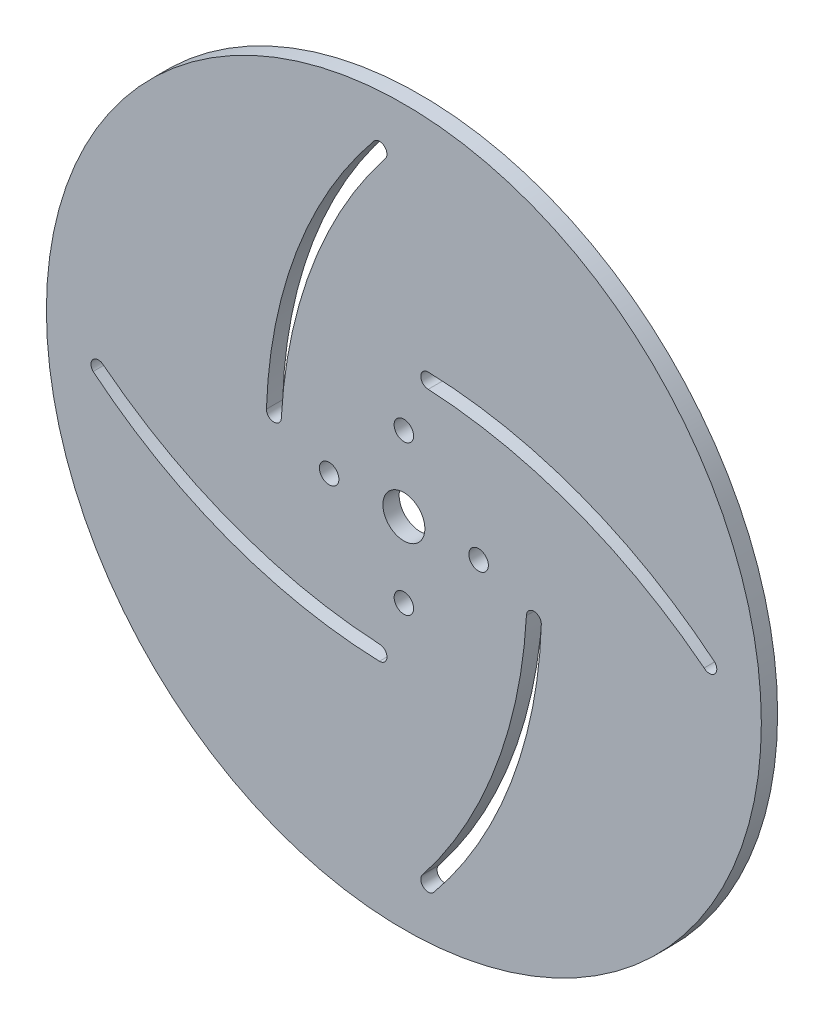
ISO-10303-21;
HEADER;
FILE_DESCRIPTION(('STEP AP214'),'2;1');
FILE_NAME('part.step','',(''),(''),'','','');
FILE_SCHEMA(('AUTOMOTIVE_DESIGN { 1 0 10303 214 1 1 1 1 }'));
ENDSEC;
DATA;
#1=APPLICATION_CONTEXT('core data for automotive mechanical design processes');
#2=APPLICATION_PROTOCOL_DEFINITION('international standard','automotive_design',2000,#1);
#3=PRODUCT_CONTEXT('',#1,'mechanical');
#4=PRODUCT('Part','Part','',(#3));
#5=PRODUCT_RELATED_PRODUCT_CATEGORY('part','',(#4));
#6=PRODUCT_DEFINITION_FORMATION('','',#4);
#7=PRODUCT_DEFINITION_CONTEXT('part definition',#1,'design');
#8=PRODUCT_DEFINITION('design','',#6,#7);
#9=PRODUCT_DEFINITION_SHAPE('','',#8);
#10=(LENGTH_UNIT() NAMED_UNIT(*) SI_UNIT(.MILLI.,.METRE.));
#11=(NAMED_UNIT(*) PLANE_ANGLE_UNIT() SI_UNIT($,.RADIAN.));
#12=(NAMED_UNIT(*) SI_UNIT($,.STERADIAN.) SOLID_ANGLE_UNIT());
#13=UNCERTAINTY_MEASURE_WITH_UNIT(LENGTH_MEASURE(1.E-05),#10,'distance_accuracy_value','');
#14=(GEOMETRIC_REPRESENTATION_CONTEXT(3) GLOBAL_UNCERTAINTY_ASSIGNED_CONTEXT((#13)) GLOBAL_UNIT_ASSIGNED_CONTEXT((#10,
#11,#12)) REPRESENTATION_CONTEXT('',''));
#15=CARTESIAN_POINT('',(0.,0.,0.));
#16=DIRECTION('',(0.,0.,1.));
#17=DIRECTION('',(1.,0.,0.));
#18=AXIS2_PLACEMENT_3D('',#15,#16,#17);
#19=CARTESIAN_POINT('',(0.,0.,3.175));
#20=DIRECTION('',(0.,0.,1.));
#21=DIRECTION('',(1.,0.,0.));
#22=AXIS2_PLACEMENT_3D('',#19,#20,#21);
#23=PLANE('',#22);
#24=CARTESIAN_POINT('',(14.605,0.,3.175));
#25=DIRECTION('',(0.,0.,1.));
#26=DIRECTION('',(1.,0.,0.));
#27=AXIS2_PLACEMENT_3D('',#24,#25,#26);
#28=CIRCLE('',#27,1.905);
#29=CARTESIAN_POINT('',(16.51,0.,3.175));
#30=VERTEX_POINT('',#29);
#31=EDGE_CURVE('E372',#30,#30,#28,.T.);
#32=ORIENTED_EDGE('',*,*,#31,.F.);
#33=EDGE_LOOP('',(#32));
#34=FACE_BOUND('',#33,.T.);
#35=CARTESIAN_POINT('',(0.,-14.605,3.175));
#36=DIRECTION('',(0.,0.,1.));
#37=DIRECTION('',(1.,0.,0.));
#38=AXIS2_PLACEMENT_3D('',#35,#36,#37);
#39=CIRCLE('',#38,1.905);
#40=CARTESIAN_POINT('',(1.90499999999995,-14.605,3.175));
#41=VERTEX_POINT('',#40);
#42=EDGE_CURVE('E376',#41,#41,#39,.T.);
#43=ORIENTED_EDGE('',*,*,#42,.F.);
#44=EDGE_LOOP('',(#43));
#45=FACE_BOUND('',#44,.T.);
#46=CARTESIAN_POINT('',(-14.605,1.01986169907608E-13,3.175));
#47=DIRECTION('',(0.,0.,1.));
#48=DIRECTION('',(1.,0.,0.));
#49=AXIS2_PLACEMENT_3D('',#46,#47,#48);
#50=CIRCLE('',#49,1.905);
#51=CARTESIAN_POINT('',(-12.7,1.01986169907608E-13,3.175));
#52=VERTEX_POINT('',#51);
#53=EDGE_CURVE('E380',#52,#52,#50,.T.);
#54=ORIENTED_EDGE('',*,*,#53,.F.);
#55=EDGE_LOOP('',(#54));
#56=FACE_BOUND('',#55,.T.);
#57=CARTESIAN_POINT('',(1.52979254861412E-13,14.605,3.175));
#58=DIRECTION('',(0.,0.,1.));
#59=DIRECTION('',(1.,0.,0.));
#60=AXIS2_PLACEMENT_3D('',#57,#58,#59);
#61=CIRCLE('',#60,1.905);
#62=CARTESIAN_POINT('',(1.90500000000015,14.605,3.175));
#63=VERTEX_POINT('',#62);
#64=EDGE_CURVE('E384',#63,#63,#61,.T.);
#65=ORIENTED_EDGE('',*,*,#64,.F.);
#66=EDGE_LOOP('',(#65));
#67=FACE_BOUND('',#66,.T.);
#68=CARTESIAN_POINT('',(0.,0.,3.175));
#69=DIRECTION('',(0.,0.,1.));
#70=DIRECTION('',(1.,0.,0.));
#71=AXIS2_PLACEMENT_3D('',#68,#69,#70);
#72=CIRCLE('',#71,69.85);
#73=CARTESIAN_POINT('',(69.85,0.,3.175));
#74=VERTEX_POINT('',#73);
#75=EDGE_CURVE('E11',#74,#74,#72,.T.);
#76=ORIENTED_EDGE('',*,*,#75,.T.);
#77=EDGE_LOOP('',(#76));
#78=FACE_BOUND('',#77,.T.);
#79=CARTESIAN_POINT('',(0.,0.,3.175));
#80=DIRECTION('',(0.,0.,1.));
#81=DIRECTION('',(1.,0.,0.));
#82=AXIS2_PLACEMENT_3D('',#79,#80,#81);
#83=CIRCLE('',#82,4.1);
#84=CARTESIAN_POINT('',(4.1,0.,3.175));
#85=VERTEX_POINT('',#84);
#86=EDGE_CURVE('E337',#85,#85,#83,.T.);
#87=ORIENTED_EDGE('',*,*,#86,.F.);
#88=EDGE_LOOP('',(#87));
#89=FACE_BOUND('',#88,.T.);
#90=CARTESIAN_POINT('',(71.7708058026314,-0.380003685692111,3.175));
#91=DIRECTION('',(0.,0.,-1.));
#92=DIRECTION('',(-1.,0.,0.));
#93=AXIS2_PLACEMENT_3D('',#90,#91,#92);
#94=CIRCLE('',#93,95.8518294787441);
#95=CARTESIAN_POINT('',(-23.9429752242943,4.76249920219739,3.175));
#96=VERTEX_POINT('',#95);
#97=CARTESIAN_POINT('',(-3.73659518151881,58.6640951815188,3.175));
#98=VERTEX_POINT('',#97);
#99=EDGE_CURVE('E297',#96,#98,#94,.T.);
#100=ORIENTED_EDGE('',*,*,#99,.F.);
#101=CARTESIAN_POINT('',(-25.3999230379934,4.76249920219739,3.175));
#102=DIRECTION('',(0.,0.,1.));
#103=DIRECTION('',(1.,0.,0.));
#104=AXIS2_PLACEMENT_3D('',#101,#102,#103);
#105=CIRCLE('',#104,1.45694781369914);
#106=CARTESIAN_POINT('',(-26.8567925777632,4.77760138527487,3.175));
#107=VERTEX_POINT('',#106);
#108=EDGE_CURVE('E294',#107,#96,#105,.T.);
#109=ORIENTED_EDGE('',*,*,#108,.F.);
#110=CARTESIAN_POINT('',(66.0400624487728,1.72599674302421,3.175));
#111=DIRECTION('',(0.,0.,1.));
#112=DIRECTION('',(1.,0.,0.));
#113=AXIS2_PLACEMENT_3D('',#110,#111,#112);
#114=CIRCLE('',#113,92.9469631817729);
#115=CARTESIAN_POINT('',(-5.78840481848121,60.7159048184812,3.175));
#116=VERTEX_POINT('',#115);
#117=EDGE_CURVE('E305',#116,#107,#114,.T.);
#118=ORIENTED_EDGE('',*,*,#117,.F.);
#119=CARTESIAN_POINT('',(-4.7625,59.69,3.175));
#120=DIRECTION('',(0.,0.,1.));
#121=DIRECTION('',(-1.,0.,0.));
#122=AXIS2_PLACEMENT_3D('',#119,#120,#121);
#123=CIRCLE('',#122,1.450848508);
#124=EDGE_CURVE('E301',#98,#116,#123,.T.);
#125=ORIENTED_EDGE('',*,*,#124,.F.);
#126=EDGE_LOOP('',(#100,#109,#118,#125));
#127=FACE_BOUND('',#126,.T.);
#128=CARTESIAN_POINT('',(59.69,4.76249999999979,3.175));
#129=DIRECTION('',(0.,0.,1.));
#130=DIRECTION('',(-1.,0.,0.));
#131=AXIS2_PLACEMENT_3D('',#128,#129,#130);
#132=CIRCLE('',#131,1.450848508);
#133=CARTESIAN_POINT('',(58.6640951815188,3.73659518151859,3.175));
#134=VERTEX_POINT('',#133);
#135=CARTESIAN_POINT('',(60.7159048184812,5.78840481848095,3.175));
#136=VERTEX_POINT('',#135);
#137=EDGE_CURVE('E254',#134,#136,#132,.T.);
#138=ORIENTED_EDGE('',*,*,#137,.F.);
#139=CARTESIAN_POINT('',(-0.380003685692362,-71.7708058026314,3.175));
#140=DIRECTION('',(0.,0.,-1.));
#141=DIRECTION('',(-1.,0.,0.));
#142=AXIS2_PLACEMENT_3D('',#139,#140,#141);
#143=CIRCLE('',#142,95.8518294787441);
#144=CARTESIAN_POINT('',(4.76249920219747,23.9429752242943,3.175));
#145=VERTEX_POINT('',#144);
#146=EDGE_CURVE('E251',#145,#134,#143,.T.);
#147=ORIENTED_EDGE('',*,*,#146,.F.);
#148=CARTESIAN_POINT('',(4.76249920219748,25.3999230379934,3.175));
#149=DIRECTION('',(0.,0.,1.));
#150=DIRECTION('',(1.,0.,0.));
#151=AXIS2_PLACEMENT_3D('',#148,#149,#150);
#152=CIRCLE('',#151,1.45694781369914);
#153=CARTESIAN_POINT('',(4.77760138527496,26.8567925777632,3.175));
#154=VERTEX_POINT('',#153);
#155=EDGE_CURVE('E262',#154,#145,#152,.T.);
#156=ORIENTED_EDGE('',*,*,#155,.F.);
#157=CARTESIAN_POINT('',(1.72599674302395,-66.0400624487724,3.175));
#158=DIRECTION('',(0.,0.,1.));
#159=DIRECTION('',(1.,0.,0.));
#160=AXIS2_PLACEMENT_3D('',#157,#158,#159);
#161=CIRCLE('',#160,92.9469631817725);
#162=EDGE_CURVE('E258',#136,#154,#161,.T.);
#163=ORIENTED_EDGE('',*,*,#162,.F.);
#164=EDGE_LOOP('',(#138,#147,#156,#163));
#165=FACE_BOUND('',#164,.T.);
#166=CARTESIAN_POINT('',(4.76249999999958,-59.69,3.175));
#167=DIRECTION('',(0.,0.,1.));
#168=DIRECTION('',(-1.,0.,0.));
#169=AXIS2_PLACEMENT_3D('',#166,#167,#168);
#170=CIRCLE('',#169,1.450848508);
#171=CARTESIAN_POINT('',(3.73659518151839,-58.6640951815189,3.175));
#172=VERTEX_POINT('',#171);
#173=CARTESIAN_POINT('',(5.7884048184807,-60.7159048184812,3.175));
#174=VERTEX_POINT('',#173);
#175=EDGE_CURVE('E211',#172,#174,#170,.T.);
#176=ORIENTED_EDGE('',*,*,#175,.F.);
#177=CARTESIAN_POINT('',(-71.7708058026314,0.380003685692614,3.175));
#178=DIRECTION('',(0.,0.,-1.));
#179=DIRECTION('',(-1.,0.,0.));
#180=AXIS2_PLACEMENT_3D('',#177,#178,#179);
#181=CIRCLE('',#180,95.8518294787441);
#182=CARTESIAN_POINT('',(23.9429752242942,-4.76249920219756,3.175));
#183=VERTEX_POINT('',#182);
#184=EDGE_CURVE('E208',#183,#172,#181,.T.);
#185=ORIENTED_EDGE('',*,*,#184,.F.);
#186=CARTESIAN_POINT('',(25.3999230379934,-4.76249920219757,3.175));
#187=DIRECTION('',(0.,0.,1.));
#188=DIRECTION('',(1.,0.,0.));
#189=AXIS2_PLACEMENT_3D('',#186,#187,#188);
#190=CIRCLE('',#189,1.45694781369914);
#191=CARTESIAN_POINT('',(26.8567925777632,-4.77760138527506,3.175));
#192=VERTEX_POINT('',#191);
#193=EDGE_CURVE('E219',#192,#183,#190,.T.);
#194=ORIENTED_EDGE('',*,*,#193,.F.);
#195=CARTESIAN_POINT('',(-66.0400624487727,-1.72599674302355,3.175));
#196=DIRECTION('',(0.,0.,1.));
#197=DIRECTION('',(1.,0.,0.));
#198=AXIS2_PLACEMENT_3D('',#195,#196,#197);
#199=CIRCLE('',#198,92.9469631817728);
#200=EDGE_CURVE('E215',#174,#192,#199,.T.);
#201=ORIENTED_EDGE('',*,*,#200,.F.);
#202=EDGE_LOOP('',(#176,#185,#194,#201));
#203=FACE_BOUND('',#202,.T.);
#204=CARTESIAN_POINT('',(-59.69,-4.76249999999938,3.175));
#205=DIRECTION('',(0.,0.,1.));
#206=DIRECTION('',(-1.,0.,0.));
#207=AXIS2_PLACEMENT_3D('',#204,#205,#206);
#208=CIRCLE('',#207,1.450848508);
#209=CARTESIAN_POINT('',(-58.6640951815189,-3.73659518151819,3.175));
#210=VERTEX_POINT('',#209);
#211=CARTESIAN_POINT('',(-60.7159048184813,-5.78840481848066,3.175));
#212=VERTEX_POINT('',#211);
#213=EDGE_CURVE('E167',#210,#212,#208,.T.);
#214=ORIENTED_EDGE('',*,*,#213,.F.);
#215=CARTESIAN_POINT('',(0.380003685692863,71.7708058026314,3.175));
#216=DIRECTION('',(0.,0.,-1.));
#217=DIRECTION('',(-1.,0.,0.));
#218=AXIS2_PLACEMENT_3D('',#215,#216,#217);
#219=CIRCLE('',#218,95.8518294787441);
#220=CARTESIAN_POINT('',(-4.76249920219764,-23.9429752242942,3.175));
#221=VERTEX_POINT('',#220);
#222=EDGE_CURVE('E158',#221,#210,#219,.T.);
#223=ORIENTED_EDGE('',*,*,#222,.F.);
#224=CARTESIAN_POINT('',(-4.76249920219766,-25.3999230379934,3.175));
#225=DIRECTION('',(0.,0.,1.));
#226=DIRECTION('',(1.,0.,0.));
#227=AXIS2_PLACEMENT_3D('',#224,#225,#226);
#228=CIRCLE('',#227,1.45694781369914);
#229=CARTESIAN_POINT('',(-4.77760138527515,-26.8567925777631,3.175));
#230=VERTEX_POINT('',#229);
#231=EDGE_CURVE('E184',#230,#221,#228,.T.);
#232=ORIENTED_EDGE('',*,*,#231,.F.);
#233=CARTESIAN_POINT('',(-1.72599674302382,66.0400624487731,3.175));
#234=DIRECTION('',(0.,0.,1.));
#235=DIRECTION('',(1.,0.,0.));
#236=AXIS2_PLACEMENT_3D('',#233,#234,#235);
#237=CIRCLE('',#236,92.946963181773);
#238=EDGE_CURVE('E180',#212,#230,#237,.T.);
#239=ORIENTED_EDGE('',*,*,#238,.F.);
#240=EDGE_LOOP('',(#214,#223,#232,#239));
#241=FACE_BOUND('',#240,.T.);
#242=ADVANCED_FACE('F44',(#34,#45,#56,#67,#78,#89,#127,#165,#203,#241),#23,.T.);
#243=CARTESIAN_POINT('',(0.,0.,0.));
#244=DIRECTION('',(0.,0.,1.));
#245=DIRECTION('',(1.,0.,0.));
#246=AXIS2_PLACEMENT_3D('',#243,#244,#245);
#247=PLANE('',#246);
#248=CARTESIAN_POINT('',(14.605,0.,0.));
#249=DIRECTION('',(0.,0.,1.));
#250=DIRECTION('',(1.,0.,0.));
#251=AXIS2_PLACEMENT_3D('',#248,#249,#250);
#252=CIRCLE('',#251,1.905);
#253=CARTESIAN_POINT('',(16.51,0.,0.));
#254=VERTEX_POINT('',#253);
#255=EDGE_CURVE('E192',#254,#254,#252,.T.);
#256=ORIENTED_EDGE('',*,*,#255,.T.);
#257=EDGE_LOOP('',(#256));
#258=FACE_BOUND('',#257,.T.);
#259=CARTESIAN_POINT('',(0.,-14.605,0.));
#260=DIRECTION('',(0.,0.,1.));
#261=DIRECTION('',(1.,0.,0.));
#262=AXIS2_PLACEMENT_3D('',#259,#260,#261);
#263=CIRCLE('',#262,1.905);
#264=CARTESIAN_POINT('',(1.90499999999995,-14.605,0.));
#265=VERTEX_POINT('',#264);
#266=EDGE_CURVE('E603',#265,#265,#263,.T.);
#267=ORIENTED_EDGE('',*,*,#266,.T.);
#268=EDGE_LOOP('',(#267));
#269=FACE_BOUND('',#268,.T.);
#270=CARTESIAN_POINT('',(-14.605,1.01986169907608E-13,0.));
#271=DIRECTION('',(0.,0.,1.));
#272=DIRECTION('',(1.,0.,0.));
#273=AXIS2_PLACEMENT_3D('',#270,#271,#272);
#274=CIRCLE('',#273,1.905);
#275=CARTESIAN_POINT('',(-12.7,1.01986169907608E-13,0.));
#276=VERTEX_POINT('',#275);
#277=EDGE_CURVE('E611',#276,#276,#274,.T.);
#278=ORIENTED_EDGE('',*,*,#277,.T.);
#279=EDGE_LOOP('',(#278));
#280=FACE_BOUND('',#279,.T.);
#281=CARTESIAN_POINT('',(1.52979254861412E-13,14.605,0.));
#282=DIRECTION('',(0.,0.,1.));
#283=DIRECTION('',(1.,0.,0.));
#284=AXIS2_PLACEMENT_3D('',#281,#282,#283);
#285=CIRCLE('',#284,1.905);
#286=CARTESIAN_POINT('',(1.90500000000015,14.605,0.));
#287=VERTEX_POINT('',#286);
#288=EDGE_CURVE('E616',#287,#287,#285,.T.);
#289=ORIENTED_EDGE('',*,*,#288,.T.);
#290=EDGE_LOOP('',(#289));
#291=FACE_BOUND('',#290,.T.);
#292=CARTESIAN_POINT('',(-71.7708058026314,0.380003685692614,0.));
#293=DIRECTION('',(0.,0.,-1.));
#294=DIRECTION('',(-1.,0.,0.));
#295=AXIS2_PLACEMENT_3D('',#292,#293,#294);
#296=CIRCLE('',#295,95.8518294787441);
#297=CARTESIAN_POINT('',(23.9429752242942,-4.76249920219756,0.));
#298=VERTEX_POINT('',#297);
#299=CARTESIAN_POINT('',(3.73659518151839,-58.6640951815189,0.));
#300=VERTEX_POINT('',#299);
#301=EDGE_CURVE('E176',#298,#300,#296,.T.);
#302=ORIENTED_EDGE('',*,*,#301,.T.);
#303=CARTESIAN_POINT('',(4.76249999999958,-59.69,0.));
#304=DIRECTION('',(0.,0.,1.));
#305=DIRECTION('',(-1.,0.,0.));
#306=AXIS2_PLACEMENT_3D('',#303,#304,#305);
#307=CIRCLE('',#306,1.450848508);
#308=CARTESIAN_POINT('',(5.7884048184807,-60.7159048184812,0.));
#309=VERTEX_POINT('',#308);
#310=EDGE_CURVE('E226',#300,#309,#307,.T.);
#311=ORIENTED_EDGE('',*,*,#310,.T.);
#312=CARTESIAN_POINT('',(-66.0400624487727,-1.72599674302355,0.));
#313=DIRECTION('',(0.,0.,1.));
#314=DIRECTION('',(1.,0.,0.));
#315=AXIS2_PLACEMENT_3D('',#312,#313,#314);
#316=CIRCLE('',#315,92.9469631817728);
#317=CARTESIAN_POINT('',(26.8567925777632,-4.77760138527506,0.));
#318=VERTEX_POINT('',#317);
#319=EDGE_CURVE('E230',#309,#318,#316,.T.);
#320=ORIENTED_EDGE('',*,*,#319,.T.);
#321=CARTESIAN_POINT('',(25.3999230379934,-4.76249920219757,0.));
#322=DIRECTION('',(0.,0.,1.));
#323=DIRECTION('',(1.,0.,0.));
#324=AXIS2_PLACEMENT_3D('',#321,#322,#323);
#325=CIRCLE('',#324,1.45694781369914);
#326=EDGE_CURVE('E212',#318,#298,#325,.T.);
#327=ORIENTED_EDGE('',*,*,#326,.T.);
#328=EDGE_LOOP('',(#302,#311,#320,#327));
#329=FACE_BOUND('',#328,.T.);
#330=CARTESIAN_POINT('',(-25.3999230379934,4.76249920219739,0.));
#331=DIRECTION('',(0.,0.,1.));
#332=DIRECTION('',(1.,0.,0.));
#333=AXIS2_PLACEMENT_3D('',#330,#331,#332);
#334=CIRCLE('',#333,1.45694781369914);
#335=CARTESIAN_POINT('',(-26.8567925777632,4.77760138527487,0.));
#336=VERTEX_POINT('',#335);
#337=CARTESIAN_POINT('',(-23.9429752242943,4.76249920219739,0.));
#338=VERTEX_POINT('',#337);
#339=EDGE_CURVE('E293',#336,#338,#334,.T.);
#340=ORIENTED_EDGE('',*,*,#339,.T.);
#341=CARTESIAN_POINT('',(71.7708058026314,-0.380003685692111,0.));
#342=DIRECTION('',(0.,0.,-1.));
#343=DIRECTION('',(-1.,0.,0.));
#344=AXIS2_PLACEMENT_3D('',#341,#342,#343);
#345=CIRCLE('',#344,95.8518294787441);
#346=CARTESIAN_POINT('',(-3.73659518151881,58.6640951815188,0.));
#347=VERTEX_POINT('',#346);
#348=EDGE_CURVE('E312',#338,#347,#345,.T.);
#349=ORIENTED_EDGE('',*,*,#348,.T.);
#350=CARTESIAN_POINT('',(-4.7625,59.69,0.));
#351=DIRECTION('',(0.,0.,1.));
#352=DIRECTION('',(-1.,0.,0.));
#353=AXIS2_PLACEMENT_3D('',#350,#351,#352);
#354=CIRCLE('',#353,1.450848508);
#355=CARTESIAN_POINT('',(-5.78840481848119,60.7159048184812,0.));
#356=VERTEX_POINT('',#355);
#357=EDGE_CURVE('E316',#347,#356,#354,.T.);
#358=ORIENTED_EDGE('',*,*,#357,.T.);
#359=CARTESIAN_POINT('',(66.0400624487728,1.72599674302421,0.));
#360=DIRECTION('',(0.,0.,1.));
#361=DIRECTION('',(1.,0.,0.));
#362=AXIS2_PLACEMENT_3D('',#359,#360,#361);
#363=CIRCLE('',#362,92.9469631817729);
#364=EDGE_CURVE('E298',#356,#336,#363,.T.);
#365=ORIENTED_EDGE('',*,*,#364,.T.);
#366=EDGE_LOOP('',(#340,#349,#358,#365));
#367=FACE_BOUND('',#366,.T.);
#368=CARTESIAN_POINT('',(0.,0.,0.));
#369=DIRECTION('',(0.,0.,1.));
#370=DIRECTION('',(1.,0.,0.));
#371=AXIS2_PLACEMENT_3D('',#368,#369,#370);
#372=CIRCLE('',#371,69.85);
#373=CARTESIAN_POINT('',(69.85,0.,0.));
#374=VERTEX_POINT('',#373);
#375=EDGE_CURVE('E48',#374,#374,#372,.T.);
#376=ORIENTED_EDGE('',*,*,#375,.F.);
#377=EDGE_LOOP('',(#376));
#378=FACE_BOUND('',#377,.T.);
#379=CARTESIAN_POINT('',(0.,0.,0.));
#380=DIRECTION('',(0.,0.,1.));
#381=DIRECTION('',(1.,0.,0.));
#382=AXIS2_PLACEMENT_3D('',#379,#380,#381);
#383=CIRCLE('',#382,4.1);
#384=CARTESIAN_POINT('',(4.1,0.,0.));
#385=VERTEX_POINT('',#384);
#386=EDGE_CURVE('E336',#385,#385,#383,.T.);
#387=ORIENTED_EDGE('',*,*,#386,.T.);
#388=EDGE_LOOP('',(#387));
#389=FACE_BOUND('',#388,.T.);
#390=CARTESIAN_POINT('',(-0.380003685692362,-71.7708058026314,0.));
#391=DIRECTION('',(0.,0.,-1.));
#392=DIRECTION('',(-1.,0.,0.));
#393=AXIS2_PLACEMENT_3D('',#390,#391,#392);
#394=CIRCLE('',#393,95.8518294787441);
#395=CARTESIAN_POINT('',(4.76249920219747,23.9429752242943,0.));
#396=VERTEX_POINT('',#395);
#397=CARTESIAN_POINT('',(58.6640951815188,3.73659518151859,0.));
#398=VERTEX_POINT('',#397);
#399=EDGE_CURVE('E250',#396,#398,#394,.T.);
#400=ORIENTED_EDGE('',*,*,#399,.T.);
#401=CARTESIAN_POINT('',(59.69,4.76249999999979,0.));
#402=DIRECTION('',(0.,0.,1.));
#403=DIRECTION('',(-1.,0.,0.));
#404=AXIS2_PLACEMENT_3D('',#401,#402,#403);
#405=CIRCLE('',#404,1.450848508);
#406=CARTESIAN_POINT('',(60.7159048184812,5.78840481848095,0.));
#407=VERTEX_POINT('',#406);
#408=EDGE_CURVE('E269',#398,#407,#405,.T.);
#409=ORIENTED_EDGE('',*,*,#408,.T.);
#410=CARTESIAN_POINT('',(1.72599674302395,-66.0400624487724,0.));
#411=DIRECTION('',(0.,0.,1.));
#412=DIRECTION('',(1.,0.,0.));
#413=AXIS2_PLACEMENT_3D('',#410,#411,#412);
#414=CIRCLE('',#413,92.9469631817725);
#415=CARTESIAN_POINT('',(4.77760138527496,26.8567925777632,0.));
#416=VERTEX_POINT('',#415);
#417=EDGE_CURVE('E273',#407,#416,#414,.T.);
#418=ORIENTED_EDGE('',*,*,#417,.T.);
#419=CARTESIAN_POINT('',(4.76249920219748,25.3999230379934,0.));
#420=DIRECTION('',(0.,0.,1.));
#421=DIRECTION('',(1.,0.,0.));
#422=AXIS2_PLACEMENT_3D('',#419,#420,#421);
#423=CIRCLE('',#422,1.45694781369914);
#424=EDGE_CURVE('E255',#416,#396,#423,.T.);
#425=ORIENTED_EDGE('',*,*,#424,.T.);
#426=EDGE_LOOP('',(#400,#409,#418,#425));
#427=FACE_BOUND('',#426,.T.);
#428=CARTESIAN_POINT('',(0.380003685692863,71.7708058026314,0.));
#429=DIRECTION('',(0.,0.,-1.));
#430=DIRECTION('',(-1.,0.,0.));
#431=AXIS2_PLACEMENT_3D('',#428,#429,#430);
#432=CIRCLE('',#431,95.8518294787441);
#433=CARTESIAN_POINT('',(-4.76249920219764,-23.9429752242942,0.));
#434=VERTEX_POINT('',#433);
#435=CARTESIAN_POINT('',(-58.6640951815189,-3.73659518151819,0.));
#436=VERTEX_POINT('',#435);
#437=EDGE_CURVE('E68',#434,#436,#432,.T.);
#438=ORIENTED_EDGE('',*,*,#437,.T.);
#439=CARTESIAN_POINT('',(-59.69,-4.76249999999938,0.));
#440=DIRECTION('',(0.,0.,1.));
#441=DIRECTION('',(-1.,0.,0.));
#442=AXIS2_PLACEMENT_3D('',#439,#440,#441);
#443=CIRCLE('',#442,1.450848508);
#444=CARTESIAN_POINT('',(-60.7159048184813,-5.78840481848066,0.));
#445=VERTEX_POINT('',#444);
#446=EDGE_CURVE('E174',#436,#445,#443,.T.);
#447=ORIENTED_EDGE('',*,*,#446,.T.);
#448=CARTESIAN_POINT('',(-1.72599674302382,66.0400624487731,0.));
#449=DIRECTION('',(0.,0.,1.));
#450=DIRECTION('',(1.,0.,0.));
#451=AXIS2_PLACEMENT_3D('',#448,#449,#450);
#452=CIRCLE('',#451,92.946963181773);
#453=CARTESIAN_POINT('',(-4.77760138527515,-26.8567925777631,0.));
#454=VERTEX_POINT('',#453);
#455=EDGE_CURVE('E195',#445,#454,#452,.T.);
#456=ORIENTED_EDGE('',*,*,#455,.T.);
#457=CARTESIAN_POINT('',(-4.76249920219766,-25.3999230379934,0.));
#458=DIRECTION('',(0.,0.,1.));
#459=DIRECTION('',(1.,0.,0.));
#460=AXIS2_PLACEMENT_3D('',#457,#458,#459);
#461=CIRCLE('',#460,1.45694781369914);
#462=EDGE_CURVE('E168',#454,#434,#461,.T.);
#463=ORIENTED_EDGE('',*,*,#462,.T.);
#464=EDGE_LOOP('',(#438,#447,#456,#463));
#465=FACE_BOUND('',#464,.T.);
#466=ADVANCED_FACE('F345',(#258,#269,#280,#291,#329,#367,#378,#389,#427,#465),#247,.F.);
#467=CARTESIAN_POINT('',(0.,0.,3.175));
#468=DIRECTION('',(0.,0.,-1.));
#469=DIRECTION('',(-1.,0.,0.));
#470=AXIS2_PLACEMENT_3D('',#467,#468,#469);
#471=CYLINDRICAL_SURFACE('',#470,69.85);
#472=ORIENTED_EDGE('',*,*,#75,.F.);
#473=EDGE_LOOP('',(#472));
#474=FACE_BOUND('',#473,.T.);
#475=ORIENTED_EDGE('',*,*,#375,.T.);
#476=EDGE_LOOP('',(#475));
#477=FACE_BOUND('',#476,.T.);
#478=ADVANCED_FACE('F46',(#474,#477),#471,.T.);
#479=CARTESIAN_POINT('',(0.,0.,3.175));
#480=DIRECTION('',(0.,0.,-1.));
#481=DIRECTION('',(-1.,0.,0.));
#482=AXIS2_PLACEMENT_3D('',#479,#480,#481);
#483=CYLINDRICAL_SURFACE('',#482,4.1);
#484=ORIENTED_EDGE('',*,*,#86,.T.);
#485=EDGE_LOOP('',(#484));
#486=FACE_BOUND('',#485,.T.);
#487=ORIENTED_EDGE('',*,*,#386,.F.);
#488=EDGE_LOOP('',(#487));
#489=FACE_BOUND('',#488,.T.);
#490=ADVANCED_FACE('F348',(#486,#489),#483,.F.);
#491=CARTESIAN_POINT('',(-25.3999230379934,4.76249920219739,3.175));
#492=DIRECTION('',(0.,0.,-1.));
#493=DIRECTION('',(-1.,0.,0.));
#494=AXIS2_PLACEMENT_3D('',#491,#492,#493);
#495=CYLINDRICAL_SURFACE('',#494,1.45694781369914);
#496=ORIENTED_EDGE('',*,*,#339,.F.);
#497=DIRECTION('',(0.,0.,-1.));
#498=VECTOR('',#497,1.);
#499=CARTESIAN_POINT('',(-26.8567925777632,4.77760138527487,3.175));
#500=LINE('',#499,#498);
#501=EDGE_CURVE('E308',#107,#336,#500,.T.);
#502=ORIENTED_EDGE('',*,*,#501,.F.);
#503=ORIENTED_EDGE('',*,*,#108,.T.);
#504=DIRECTION('',(0.,0.,-1.));
#505=VECTOR('',#504,1.);
#506=CARTESIAN_POINT('',(-23.9429752242943,4.76249920219739,3.175));
#507=LINE('',#506,#505);
#508=EDGE_CURVE('E332',#96,#338,#507,.T.);
#509=ORIENTED_EDGE('',*,*,#508,.T.);
#510=EDGE_LOOP('',(#496,#502,#503,#509));
#511=FACE_BOUND('',#510,.T.);
#512=ADVANCED_FACE('F350',(#511),#495,.F.);
#513=CARTESIAN_POINT('',(71.7708058026314,-0.380003685692111,3.175));
#514=DIRECTION('',(0.,0.,-1.));
#515=DIRECTION('',(-1.,0.,0.));
#516=AXIS2_PLACEMENT_3D('',#513,#514,#515);
#517=CYLINDRICAL_SURFACE('',#516,95.8518294787441);
#518=ORIENTED_EDGE('',*,*,#348,.F.);
#519=ORIENTED_EDGE('',*,*,#508,.F.);
#520=ORIENTED_EDGE('',*,*,#99,.T.);
#521=DIRECTION('',(0.,0.,-1.));
#522=VECTOR('',#521,1.);
#523=CARTESIAN_POINT('',(-3.73659518151881,58.6640951815188,3.175));
#524=LINE('',#523,#522);
#525=EDGE_CURVE('E329',#98,#347,#524,.T.);
#526=ORIENTED_EDGE('',*,*,#525,.T.);
#527=EDGE_LOOP('',(#518,#519,#520,#526));
#528=FACE_BOUND('',#527,.T.);
#529=ADVANCED_FACE('F357',(#528),#517,.T.);
#530=CARTESIAN_POINT('',(-4.7625,59.69,3.175));
#531=DIRECTION('',(0.,0.,-1.));
#532=DIRECTION('',(-1.,0.,0.));
#533=AXIS2_PLACEMENT_3D('',#530,#531,#532);
#534=CYLINDRICAL_SURFACE('',#533,1.450848508);
#535=ORIENTED_EDGE('',*,*,#357,.F.);
#536=ORIENTED_EDGE('',*,*,#525,.F.);
#537=ORIENTED_EDGE('',*,*,#124,.T.);
#538=DIRECTION('',(0.,0.,-1.));
#539=VECTOR('',#538,1.);
#540=CARTESIAN_POINT('',(-5.78840481848119,60.7159048184812,3.175));
#541=LINE('',#540,#539);
#542=EDGE_CURVE('E326',#116,#356,#541,.T.);
#543=ORIENTED_EDGE('',*,*,#542,.T.);
#544=EDGE_LOOP('',(#535,#536,#537,#543));
#545=FACE_BOUND('',#544,.T.);
#546=ADVANCED_FACE('F449',(#545),#534,.F.);
#547=CARTESIAN_POINT('',(66.0400624487728,1.72599674302421,3.175));
#548=DIRECTION('',(0.,0.,-1.));
#549=DIRECTION('',(-1.,0.,0.));
#550=AXIS2_PLACEMENT_3D('',#547,#548,#549);
#551=CYLINDRICAL_SURFACE('',#550,92.9469631817729);
#552=ORIENTED_EDGE('',*,*,#364,.F.);
#553=ORIENTED_EDGE('',*,*,#542,.F.);
#554=ORIENTED_EDGE('',*,*,#117,.T.);
#555=ORIENTED_EDGE('',*,*,#501,.T.);
#556=EDGE_LOOP('',(#552,#553,#554,#555));
#557=FACE_BOUND('',#556,.T.);
#558=ADVANCED_FACE('F445',(#557),#551,.F.);
#559=CARTESIAN_POINT('',(-0.380003685692362,-71.7708058026314,3.175));
#560=DIRECTION('',(0.,0.,-1.));
#561=DIRECTION('',(-1.,0.,0.));
#562=AXIS2_PLACEMENT_3D('',#559,#560,#561);
#563=CYLINDRICAL_SURFACE('',#562,95.8518294787441);
#564=ORIENTED_EDGE('',*,*,#399,.F.);
#565=DIRECTION('',(0.,0.,-1.));
#566=VECTOR('',#565,1.);
#567=CARTESIAN_POINT('',(4.76249920219747,23.9429752242943,3.175));
#568=LINE('',#567,#566);
#569=EDGE_CURVE('E265',#145,#396,#568,.T.);
#570=ORIENTED_EDGE('',*,*,#569,.F.);
#571=ORIENTED_EDGE('',*,*,#146,.T.);
#572=DIRECTION('',(0.,0.,-1.));
#573=VECTOR('',#572,1.);
#574=CARTESIAN_POINT('',(58.6640951815188,3.73659518151859,3.175));
#575=LINE('',#574,#573);
#576=EDGE_CURVE('E289',#134,#398,#575,.T.);
#577=ORIENTED_EDGE('',*,*,#576,.T.);
#578=EDGE_LOOP('',(#564,#570,#571,#577));
#579=FACE_BOUND('',#578,.T.);
#580=ADVANCED_FACE('F441',(#579),#563,.T.);
#581=CARTESIAN_POINT('',(59.69,4.76249999999979,3.175));
#582=DIRECTION('',(0.,0.,-1.));
#583=DIRECTION('',(-1.,0.,0.));
#584=AXIS2_PLACEMENT_3D('',#581,#582,#583);
#585=CYLINDRICAL_SURFACE('',#584,1.450848508);
#586=ORIENTED_EDGE('',*,*,#408,.F.);
#587=ORIENTED_EDGE('',*,*,#576,.F.);
#588=ORIENTED_EDGE('',*,*,#137,.T.);
#589=DIRECTION('',(0.,0.,-1.));
#590=VECTOR('',#589,1.);
#591=CARTESIAN_POINT('',(60.7159048184812,5.78840481848095,3.175));
#592=LINE('',#591,#590);
#593=EDGE_CURVE('E286',#136,#407,#592,.T.);
#594=ORIENTED_EDGE('',*,*,#593,.T.);
#595=EDGE_LOOP('',(#586,#587,#588,#594));
#596=FACE_BOUND('',#595,.T.);
#597=ADVANCED_FACE('F437',(#596),#585,.F.);
#598=CARTESIAN_POINT('',(1.72599674302395,-66.0400624487724,3.175));
#599=DIRECTION('',(0.,0.,-1.));
#600=DIRECTION('',(-1.,0.,0.));
#601=AXIS2_PLACEMENT_3D('',#598,#599,#600);
#602=CYLINDRICAL_SURFACE('',#601,92.9469631817725);
#603=ORIENTED_EDGE('',*,*,#417,.F.);
#604=ORIENTED_EDGE('',*,*,#593,.F.);
#605=ORIENTED_EDGE('',*,*,#162,.T.);
#606=DIRECTION('',(0.,0.,-1.));
#607=VECTOR('',#606,1.);
#608=CARTESIAN_POINT('',(4.77760138527496,26.8567925777632,3.175));
#609=LINE('',#608,#607);
#610=EDGE_CURVE('E283',#154,#416,#609,.T.);
#611=ORIENTED_EDGE('',*,*,#610,.T.);
#612=EDGE_LOOP('',(#603,#604,#605,#611));
#613=FACE_BOUND('',#612,.T.);
#614=ADVANCED_FACE('F433',(#613),#602,.F.);
#615=CARTESIAN_POINT('',(4.76249920219748,25.3999230379934,3.175));
#616=DIRECTION('',(0.,0.,-1.));
#617=DIRECTION('',(-1.,0.,0.));
#618=AXIS2_PLACEMENT_3D('',#615,#616,#617);
#619=CYLINDRICAL_SURFACE('',#618,1.45694781369914);
#620=ORIENTED_EDGE('',*,*,#424,.F.);
#621=ORIENTED_EDGE('',*,*,#610,.F.);
#622=ORIENTED_EDGE('',*,*,#155,.T.);
#623=ORIENTED_EDGE('',*,*,#569,.T.);
#624=EDGE_LOOP('',(#620,#621,#622,#623));
#625=FACE_BOUND('',#624,.T.);
#626=ADVANCED_FACE('F430',(#625),#619,.F.);
#627=CARTESIAN_POINT('',(-71.7708058026314,0.380003685692614,3.175));
#628=DIRECTION('',(0.,0.,-1.));
#629=DIRECTION('',(-1.,0.,0.));
#630=AXIS2_PLACEMENT_3D('',#627,#628,#629);
#631=CYLINDRICAL_SURFACE('',#630,95.8518294787441);
#632=ORIENTED_EDGE('',*,*,#301,.F.);
#633=DIRECTION('',(0.,0.,-1.));
#634=VECTOR('',#633,1.);
#635=CARTESIAN_POINT('',(23.9429752242942,-4.76249920219756,3.175));
#636=LINE('',#635,#634);
#637=EDGE_CURVE('E222',#183,#298,#636,.T.);
#638=ORIENTED_EDGE('',*,*,#637,.F.);
#639=ORIENTED_EDGE('',*,*,#184,.T.);
#640=DIRECTION('',(0.,0.,-1.));
#641=VECTOR('',#640,1.);
#642=CARTESIAN_POINT('',(3.73659518151839,-58.6640951815189,3.175));
#643=LINE('',#642,#641);
#644=EDGE_CURVE('E246',#172,#300,#643,.T.);
#645=ORIENTED_EDGE('',*,*,#644,.T.);
#646=EDGE_LOOP('',(#632,#638,#639,#645));
#647=FACE_BOUND('',#646,.T.);
#648=ADVANCED_FACE('F412',(#647),#631,.T.);
#649=CARTESIAN_POINT('',(4.76249999999958,-59.69,3.175));
#650=DIRECTION('',(0.,0.,-1.));
#651=DIRECTION('',(-1.,0.,0.));
#652=AXIS2_PLACEMENT_3D('',#649,#650,#651);
#653=CYLINDRICAL_SURFACE('',#652,1.450848508);
#654=ORIENTED_EDGE('',*,*,#310,.F.);
#655=ORIENTED_EDGE('',*,*,#644,.F.);
#656=ORIENTED_EDGE('',*,*,#175,.T.);
#657=DIRECTION('',(0.,0.,-1.));
#658=VECTOR('',#657,1.);
#659=CARTESIAN_POINT('',(5.7884048184807,-60.7159048184812,3.175));
#660=LINE('',#659,#658);
#661=EDGE_CURVE('E243',#174,#309,#660,.T.);
#662=ORIENTED_EDGE('',*,*,#661,.T.);
#663=EDGE_LOOP('',(#654,#655,#656,#662));
#664=FACE_BOUND('',#663,.T.);
#665=ADVANCED_FACE('F404',(#664),#653,.F.);
#666=CARTESIAN_POINT('',(-66.0400624487727,-1.72599674302355,3.175));
#667=DIRECTION('',(0.,0.,-1.));
#668=DIRECTION('',(-1.,0.,0.));
#669=AXIS2_PLACEMENT_3D('',#666,#667,#668);
#670=CYLINDRICAL_SURFACE('',#669,92.9469631817728);
#671=ORIENTED_EDGE('',*,*,#319,.F.);
#672=ORIENTED_EDGE('',*,*,#661,.F.);
#673=ORIENTED_EDGE('',*,*,#200,.T.);
#674=DIRECTION('',(0.,0.,-1.));
#675=VECTOR('',#674,1.);
#676=CARTESIAN_POINT('',(26.8567925777632,-4.77760138527506,3.175));
#677=LINE('',#676,#675);
#678=EDGE_CURVE('E240',#192,#318,#677,.T.);
#679=ORIENTED_EDGE('',*,*,#678,.T.);
#680=EDGE_LOOP('',(#671,#672,#673,#679));
#681=FACE_BOUND('',#680,.T.);
#682=ADVANCED_FACE('F407',(#681),#670,.F.);
#683=CARTESIAN_POINT('',(25.3999230379934,-4.76249920219757,3.175));
#684=DIRECTION('',(0.,0.,-1.));
#685=DIRECTION('',(-1.,0.,0.));
#686=AXIS2_PLACEMENT_3D('',#683,#684,#685);
#687=CYLINDRICAL_SURFACE('',#686,1.45694781369914);
#688=ORIENTED_EDGE('',*,*,#326,.F.);
#689=ORIENTED_EDGE('',*,*,#678,.F.);
#690=ORIENTED_EDGE('',*,*,#193,.T.);
#691=ORIENTED_EDGE('',*,*,#637,.T.);
#692=EDGE_LOOP('',(#688,#689,#690,#691));
#693=FACE_BOUND('',#692,.T.);
#694=ADVANCED_FACE('F415',(#693),#687,.F.);
#695=CARTESIAN_POINT('',(0.380003685692863,71.7708058026314,3.175));
#696=DIRECTION('',(0.,0.,-1.));
#697=DIRECTION('',(-1.,0.,0.));
#698=AXIS2_PLACEMENT_3D('',#695,#696,#697);
#699=CYLINDRICAL_SURFACE('',#698,95.8518294787441);
#700=ORIENTED_EDGE('',*,*,#437,.F.);
#701=DIRECTION('',(0.,0.,-1.));
#702=VECTOR('',#701,1.);
#703=CARTESIAN_POINT('',(-4.76249920219764,-23.9429752242942,3.175));
#704=LINE('',#703,#702);
#705=EDGE_CURVE('E162',#221,#434,#704,.T.);
#706=ORIENTED_EDGE('',*,*,#705,.F.);
#707=ORIENTED_EDGE('',*,*,#222,.T.);
#708=DIRECTION('',(0.,0.,-1.));
#709=VECTOR('',#708,1.);
#710=CARTESIAN_POINT('',(-58.6640951815189,-3.73659518151819,3.175));
#711=LINE('',#710,#709);
#712=EDGE_CURVE('E161',#210,#436,#711,.T.);
#713=ORIENTED_EDGE('',*,*,#712,.T.);
#714=EDGE_LOOP('',(#700,#706,#707,#713));
#715=FACE_BOUND('',#714,.T.);
#716=ADVANCED_FACE('F160',(#715),#699,.T.);
#717=CARTESIAN_POINT('',(-59.69,-4.76249999999938,3.175));
#718=DIRECTION('',(0.,0.,-1.));
#719=DIRECTION('',(-1.,0.,0.));
#720=AXIS2_PLACEMENT_3D('',#717,#718,#719);
#721=CYLINDRICAL_SURFACE('',#720,1.450848508);
#722=ORIENTED_EDGE('',*,*,#446,.F.);
#723=ORIENTED_EDGE('',*,*,#712,.F.);
#724=ORIENTED_EDGE('',*,*,#213,.T.);
#725=DIRECTION('',(0.,0.,-1.));
#726=VECTOR('',#725,1.);
#727=CARTESIAN_POINT('',(-60.7159048184813,-5.78840481848066,3.175));
#728=LINE('',#727,#726);
#729=EDGE_CURVE('E177',#212,#445,#728,.T.);
#730=ORIENTED_EDGE('',*,*,#729,.T.);
#731=EDGE_LOOP('',(#722,#723,#724,#730));
#732=FACE_BOUND('',#731,.T.);
#733=ADVANCED_FACE('F171',(#732),#721,.F.);
#734=CARTESIAN_POINT('',(-1.72599674302382,66.0400624487731,3.175));
#735=DIRECTION('',(0.,0.,-1.));
#736=DIRECTION('',(-1.,0.,0.));
#737=AXIS2_PLACEMENT_3D('',#734,#735,#736);
#738=CYLINDRICAL_SURFACE('',#737,92.946963181773);
#739=ORIENTED_EDGE('',*,*,#455,.F.);
#740=ORIENTED_EDGE('',*,*,#729,.F.);
#741=ORIENTED_EDGE('',*,*,#238,.T.);
#742=DIRECTION('',(0.,0.,-1.));
#743=VECTOR('',#742,1.);
#744=CARTESIAN_POINT('',(-4.77760138527515,-26.8567925777631,3.175));
#745=LINE('',#744,#743);
#746=EDGE_CURVE('E60',#230,#454,#745,.T.);
#747=ORIENTED_EDGE('',*,*,#746,.T.);
#748=EDGE_LOOP('',(#739,#740,#741,#747));
#749=FACE_BOUND('',#748,.T.);
#750=ADVANCED_FACE('F536',(#749),#738,.F.);
#751=CARTESIAN_POINT('',(-4.76249920219766,-25.3999230379934,3.175));
#752=DIRECTION('',(0.,0.,-1.));
#753=DIRECTION('',(-1.,0.,0.));
#754=AXIS2_PLACEMENT_3D('',#751,#752,#753);
#755=CYLINDRICAL_SURFACE('',#754,1.45694781369914);
#756=ORIENTED_EDGE('',*,*,#462,.F.);
#757=ORIENTED_EDGE('',*,*,#746,.F.);
#758=ORIENTED_EDGE('',*,*,#231,.T.);
#759=ORIENTED_EDGE('',*,*,#705,.T.);
#760=EDGE_LOOP('',(#756,#757,#758,#759));
#761=FACE_BOUND('',#760,.T.);
#762=ADVANCED_FACE('F544',(#761),#755,.F.);
#763=CARTESIAN_POINT('',(1.52979254861412E-13,14.605,0.));
#764=DIRECTION('',(0.,0.,1.));
#765=DIRECTION('',(1.,0.,0.));
#766=AXIS2_PLACEMENT_3D('',#763,#764,#765);
#767=CYLINDRICAL_SURFACE('',#766,1.905);
#768=ORIENTED_EDGE('',*,*,#288,.F.);
#769=EDGE_LOOP('',(#768));
#770=FACE_BOUND('',#769,.T.);
#771=ORIENTED_EDGE('',*,*,#64,.T.);
#772=EDGE_LOOP('',(#771));
#773=FACE_BOUND('',#772,.T.);
#774=ADVANCED_FACE('F553',(#770,#773),#767,.F.);
#775=CARTESIAN_POINT('',(-14.605,1.01986169907608E-13,0.));
#776=DIRECTION('',(0.,0.,1.));
#777=DIRECTION('',(1.,0.,0.));
#778=AXIS2_PLACEMENT_3D('',#775,#776,#777);
#779=CYLINDRICAL_SURFACE('',#778,1.905);
#780=ORIENTED_EDGE('',*,*,#277,.F.);
#781=EDGE_LOOP('',(#780));
#782=FACE_BOUND('',#781,.T.);
#783=ORIENTED_EDGE('',*,*,#53,.T.);
#784=EDGE_LOOP('',(#783));
#785=FACE_BOUND('',#784,.T.);
#786=ADVANCED_FACE('F562',(#782,#785),#779,.F.);
#787=CARTESIAN_POINT('',(0.,-14.605,0.));
#788=DIRECTION('',(0.,0.,1.));
#789=DIRECTION('',(1.,0.,0.));
#790=AXIS2_PLACEMENT_3D('',#787,#788,#789);
#791=CYLINDRICAL_SURFACE('',#790,1.905);
#792=ORIENTED_EDGE('',*,*,#266,.F.);
#793=EDGE_LOOP('',(#792));
#794=FACE_BOUND('',#793,.T.);
#795=ORIENTED_EDGE('',*,*,#42,.T.);
#796=EDGE_LOOP('',(#795));
#797=FACE_BOUND('',#796,.T.);
#798=ADVANCED_FACE('F572',(#794,#797),#791,.F.);
#799=CARTESIAN_POINT('',(14.605,0.,0.));
#800=DIRECTION('',(0.,0.,1.));
#801=DIRECTION('',(1.,0.,0.));
#802=AXIS2_PLACEMENT_3D('',#799,#800,#801);
#803=CYLINDRICAL_SURFACE('',#802,1.905);
#804=ORIENTED_EDGE('',*,*,#255,.F.);
#805=EDGE_LOOP('',(#804));
#806=FACE_BOUND('',#805,.T.);
#807=ORIENTED_EDGE('',*,*,#31,.T.);
#808=EDGE_LOOP('',(#807));
#809=FACE_BOUND('',#808,.T.);
#810=ADVANCED_FACE('F582',(#806,#809),#803,.F.);
#811=CLOSED_SHELL('',(#242,#466,#478,#490,#512,#529,#546,#558,#580,#597,#614,#626,#648,#665,
#682,#694,#716,#733,#750,#762,#774,#786,#798,#810));
#812=MANIFOLD_SOLID_BREP('B2',#811);
#813=ADVANCED_BREP_SHAPE_REPRESENTATION('',(#18,#812),#14);
#814=SHAPE_DEFINITION_REPRESENTATION(#9,#813);
ENDSEC;
END-ISO-10303-21;
